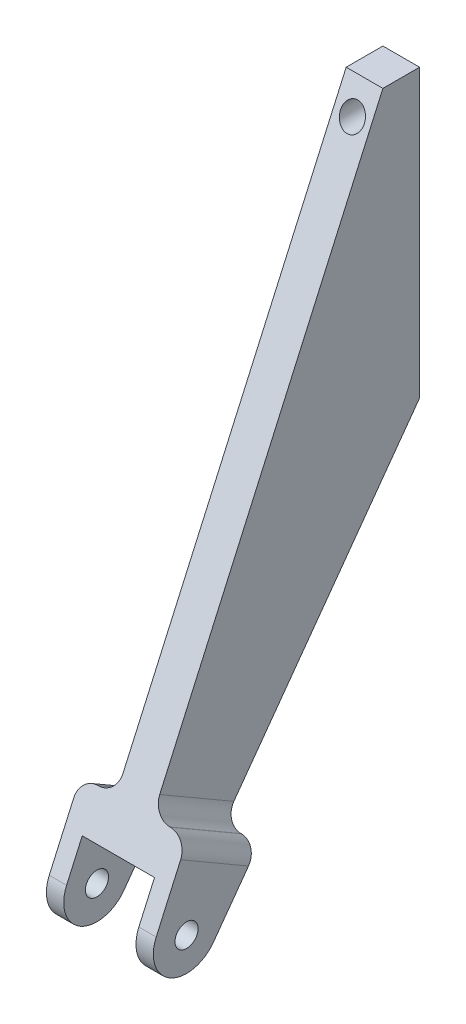
ISO-10303-21;
HEADER;
FILE_DESCRIPTION(('STEP AP214'),'2;1');
FILE_NAME('part.step','',(''),(''),'','','');
FILE_SCHEMA(('AUTOMOTIVE_DESIGN { 1 0 10303 214 1 1 1 1 }'));
ENDSEC;
DATA;
#1=APPLICATION_CONTEXT('core data for automotive mechanical design processes');
#2=APPLICATION_PROTOCOL_DEFINITION('international standard','automotive_design',2000,#1);
#3=PRODUCT_CONTEXT('',#1,'mechanical');
#4=PRODUCT('Part','Part','',(#3));
#5=PRODUCT_RELATED_PRODUCT_CATEGORY('part','',(#4));
#6=PRODUCT_DEFINITION_FORMATION('','',#4);
#7=PRODUCT_DEFINITION_CONTEXT('part definition',#1,'design');
#8=PRODUCT_DEFINITION('design','',#6,#7);
#9=PRODUCT_DEFINITION_SHAPE('','',#8);
#10=(LENGTH_UNIT() NAMED_UNIT(*) SI_UNIT(.MILLI.,.METRE.));
#11=(NAMED_UNIT(*) PLANE_ANGLE_UNIT() SI_UNIT($,.RADIAN.));
#12=(NAMED_UNIT(*) SI_UNIT($,.STERADIAN.) SOLID_ANGLE_UNIT());
#13=UNCERTAINTY_MEASURE_WITH_UNIT(LENGTH_MEASURE(1.E-05),#10,'distance_accuracy_value','');
#14=(GEOMETRIC_REPRESENTATION_CONTEXT(3) GLOBAL_UNCERTAINTY_ASSIGNED_CONTEXT((#13)) GLOBAL_UNIT_ASSIGNED_CONTEXT((#10,
#11,#12)) REPRESENTATION_CONTEXT('',''));
#15=CARTESIAN_POINT('',(0.,0.,0.));
#16=DIRECTION('',(0.,0.,1.));
#17=DIRECTION('',(1.,0.,0.));
#18=AXIS2_PLACEMENT_3D('',#15,#16,#17);
#19=CARTESIAN_POINT('',(-78.4084452466419,-210.483790761918,92.7733037843869));
#20=DIRECTION('',(1.,0.,0.));
#21=DIRECTION('',(0.,0.,-1.));
#22=AXIS2_PLACEMENT_3D('',#19,#20,#21);
#23=CYLINDRICAL_SURFACE('',#22,11.5);
#24=DIRECTION('',(1.,0.,0.));
#25=VECTOR('',#24,1.);
#26=CARTESIAN_POINT('',(-78.4084452466419,-205.796191727349,103.274561580056));
#27=LINE('',#26,#25);
#28=CARTESIAN_POINT('',(-59.5584452466419,-205.796191727349,103.274561580056));
#29=VERTEX_POINT('',#28);
#30=CARTESIAN_POINT('',(-53.558445246642,-205.796191727349,103.274561580056));
#31=VERTEX_POINT('',#30);
#32=EDGE_CURVE('E285',#29,#31,#27,.T.);
#33=ORIENTED_EDGE('',*,*,#32,.F.);
#34=CARTESIAN_POINT('',(-59.5584452466419,-210.483790761918,92.7733037843869));
#35=DIRECTION('',(-1.,0.,0.));
#36=DIRECTION('',(0.,0.,1.));
#37=AXIS2_PLACEMENT_3D('',#34,#35,#36);
#38=CIRCLE('',#37,11.5);
#39=CARTESIAN_POINT('',(-59.5584452466419,-217.229583095588,83.4596425391511));
#40=VERTEX_POINT('',#39);
#41=EDGE_CURVE('E211',#29,#40,#38,.F.);
#42=ORIENTED_EDGE('',*,*,#41,.T.);
#43=DIRECTION('',(1.,0.,0.));
#44=VECTOR('',#43,1.);
#45=CARTESIAN_POINT('',(-78.4084452466419,-217.229583095588,83.4596425391511));
#46=LINE('',#45,#44);
#47=CARTESIAN_POINT('',(-53.558445246642,-217.229583095588,83.4596425391511));
#48=VERTEX_POINT('',#47);
#49=EDGE_CURVE('E208',#40,#48,#46,.T.);
#50=ORIENTED_EDGE('',*,*,#49,.T.);
#51=CARTESIAN_POINT('',(-53.558445246642,-210.483790761918,92.7733037843869));
#52=DIRECTION('',(1.,0.,0.));
#53=DIRECTION('',(0.,0.,-1.));
#54=AXIS2_PLACEMENT_3D('',#51,#52,#53);
#55=CIRCLE('',#54,11.5);
#56=EDGE_CURVE('E236',#31,#48,#55,.T.);
#57=ORIENTED_EDGE('',*,*,#56,.F.);
#58=EDGE_LOOP('',(#33,#42,#50,#57));
#59=FACE_BOUND('',#58,.T.);
#60=ADVANCED_FACE('F63',(#59),#23,.T.);
#61=CARTESIAN_POINT('',(-78.4084452466419,-210.483790761918,92.7733037843869));
#62=DIRECTION('',(1.,0.,0.));
#63=DIRECTION('',(0.,0.,-1.));
#64=AXIS2_PLACEMENT_3D('',#61,#62,#63);
#65=CYLINDRICAL_SURFACE('',#64,4.00000000000001);
#66=CARTESIAN_POINT('',(-53.558445246642,-210.483790761918,92.7733037843869));
#67=DIRECTION('',(1.,0.,0.));
#68=DIRECTION('',(0.,0.,-1.));
#69=AXIS2_PLACEMENT_3D('',#66,#67,#68);
#70=CIRCLE('',#69,4.00000000000001);
#71=CARTESIAN_POINT('',(-53.558445246642,-210.483790761918,88.7733037843869));
#72=VERTEX_POINT('',#71);
#73=EDGE_CURVE('E228',#72,#72,#70,.T.);
#74=ORIENTED_EDGE('',*,*,#73,.T.);
#75=EDGE_LOOP('',(#74));
#76=FACE_BOUND('',#75,.T.);
#77=CARTESIAN_POINT('',(-59.5584452466419,-210.483790761918,92.7733037843869));
#78=DIRECTION('',(-1.,0.,0.));
#79=DIRECTION('',(0.,0.,1.));
#80=AXIS2_PLACEMENT_3D('',#77,#78,#79);
#81=CIRCLE('',#80,4.00000000000001);
#82=CARTESIAN_POINT('',(-59.5584452466419,-210.483790761918,96.7733037843869));
#83=VERTEX_POINT('',#82);
#84=EDGE_CURVE('E330',#83,#83,#81,.F.);
#85=ORIENTED_EDGE('',*,*,#84,.F.);
#86=EDGE_LOOP('',(#85));
#87=FACE_BOUND('',#86,.T.);
#88=ADVANCED_FACE('F439',(#76,#87),#65,.F.);
#89=CARTESIAN_POINT('',(-65.7084452466419,-322.212396424115,112.776));
#90=DIRECTION('',(-1.,0.,0.));
#91=DIRECTION('',(0.,0.,1.));
#92=AXIS2_PLACEMENT_3D('',#89,#90,#91);
#93=PLANE('',#92);
#94=DIRECTION('',(0.,-0.913152851797348,0.407617307353811));
#95=VECTOR('',#94,1.);
#96=CARTESIAN_POINT('',(-65.7084452466419,4.24711590624918,9.51447824157033));
#97=LINE('',#96,#95);
#98=CARTESIAN_POINT('',(-65.7084452466419,-2.88915683215951,12.7));
#99=VERTEX_POINT('',#98);
#100=CARTESIAN_POINT('',(-65.7084452466419,-175.850503739306,89.907269696208));
#101=VERTEX_POINT('',#100);
#102=EDGE_CURVE('E286',#99,#101,#97,.T.);
#103=ORIENTED_EDGE('',*,*,#102,.T.);
#104=DIRECTION('',(0.,0.501533068219234,0.865138475322073));
#105=VECTOR('',#104,1.);
#106=CARTESIAN_POINT('',(-65.7084452466419,-190.413005407479,64.7871304902103));
#107=LINE('',#106,#105);
#108=CARTESIAN_POINT('',(-65.7084452466419,-190.719409510616,64.2585871190584));
#109=VERTEX_POINT('',#108);
#110=EDGE_CURVE('E347',#101,#109,#107,.F.);
#111=ORIENTED_EDGE('',*,*,#110,.T.);
#112=DIRECTION('',(0.,-0.809883586542247,0.586590637710377));
#113=VECTOR('',#112,1.);
#114=CARTESIAN_POINT('',(-65.7084452466419,-35.0970347774456,-48.4571532091004));
#115=LINE('',#114,#113);
#116=CARTESIAN_POINT('',(-65.7084452466419,-102.,0.));
#117=VERTEX_POINT('',#116);
#118=EDGE_CURVE('E281',#117,#109,#115,.T.);
#119=ORIENTED_EDGE('',*,*,#118,.F.);
#120=DIRECTION('',(0.,1.,0.));
#121=VECTOR('',#120,1.);
#122=CARTESIAN_POINT('',(-65.7084452466419,-322.212396424115,0.));
#123=LINE('',#122,#121);
#124=CARTESIAN_POINT('',(-65.7084452466419,-2.88915683215951,0.));
#125=VERTEX_POINT('',#124);
#126=EDGE_CURVE('E297',#117,#125,#123,.T.);
#127=ORIENTED_EDGE('',*,*,#126,.T.);
#128=DIRECTION('',(0.,0.,-1.));
#129=VECTOR('',#128,1.);
#130=CARTESIAN_POINT('',(-65.7084452466419,-2.88915683215951,112.776));
#131=LINE('',#130,#129);
#132=EDGE_CURVE('E323',#99,#125,#131,.T.);
#133=ORIENTED_EDGE('',*,*,#132,.F.);
#134=EDGE_LOOP('',(#103,#111,#119,#127,#133));
#135=FACE_BOUND('',#134,.T.);
#136=ADVANCED_FACE('F425',(#135),#93,.F.);
#137=CARTESIAN_POINT('',(-78.4084452466419,-322.212396424115,112.776));
#138=DIRECTION('',(1.,0.,0.));
#139=DIRECTION('',(0.,0.,-1.));
#140=AXIS2_PLACEMENT_3D('',#137,#138,#139);
#141=PLANE('',#140);
#142=DIRECTION('',(0.,-0.809883586542247,0.586590637710377));
#143=VECTOR('',#142,1.);
#144=CARTESIAN_POINT('',(-78.4084452466419,-35.0970347774456,-48.4571532091004));
#145=LINE('',#144,#143);
#146=CARTESIAN_POINT('',(-78.4084452466419,-102.,0.));
#147=VERTEX_POINT('',#146);
#148=CARTESIAN_POINT('',(-78.4084452466419,-190.719409510616,64.2585871190584));
#149=VERTEX_POINT('',#148);
#150=EDGE_CURVE('E280',#147,#149,#145,.T.);
#151=ORIENTED_EDGE('',*,*,#150,.T.);
#152=DIRECTION('',(0.,-0.501533068219234,-0.865138475322073));
#153=VECTOR('',#152,1.);
#154=CARTESIAN_POINT('',(-78.4084452466419,-176.169238473201,89.3574561361695));
#155=LINE('',#154,#153);
#156=CARTESIAN_POINT('',(-78.4084452466419,-175.850503739306,89.907269696208));
#157=VERTEX_POINT('',#156);
#158=EDGE_CURVE('E340',#149,#157,#155,.F.);
#159=ORIENTED_EDGE('',*,*,#158,.T.);
#160=DIRECTION('',(0.,-0.913152851797348,0.407617307353811));
#161=VECTOR('',#160,1.);
#162=CARTESIAN_POINT('',(-78.4084452466419,4.24711590624918,9.51447824157033));
#163=LINE('',#162,#161);
#164=CARTESIAN_POINT('',(-78.4084452466419,-2.88915683215951,12.7));
#165=VERTEX_POINT('',#164);
#166=EDGE_CURVE('E276',#165,#157,#163,.T.);
#167=ORIENTED_EDGE('',*,*,#166,.F.);
#168=DIRECTION('',(0.,0.,-1.));
#169=VECTOR('',#168,1.);
#170=CARTESIAN_POINT('',(-78.4084452466419,-2.88915683215951,112.776));
#171=LINE('',#170,#169);
#172=CARTESIAN_POINT('',(-78.4084452466419,-2.88915683215951,0.));
#173=VERTEX_POINT('',#172);
#174=EDGE_CURVE('E320',#165,#173,#171,.T.);
#175=ORIENTED_EDGE('',*,*,#174,.T.);
#176=DIRECTION('',(0.,-1.,0.));
#177=VECTOR('',#176,1.);
#178=CARTESIAN_POINT('',(-78.4084452466419,-322.212396424115,0.));
#179=LINE('',#178,#177);
#180=EDGE_CURVE('E316',#173,#147,#179,.T.);
#181=ORIENTED_EDGE('',*,*,#180,.T.);
#182=EDGE_LOOP('',(#151,#159,#167,#175,#181));
#183=FACE_BOUND('',#182,.T.);
#184=ADVANCED_FACE('F414',(#183),#141,.F.);
#185=CARTESIAN_POINT('',(-78.4084452466419,-2.88915683215951,112.776));
#186=DIRECTION('',(0.,-1.,0.));
#187=DIRECTION('',(0.,0.,-1.));
#188=AXIS2_PLACEMENT_3D('',#185,#186,#187);
#189=PLANE('',#188);
#190=DIRECTION('',(1.,0.,0.));
#191=VECTOR('',#190,1.);
#192=CARTESIAN_POINT('',(-78.4084452466419,-2.88915683215951,12.7));
#193=LINE('',#192,#191);
#194=EDGE_CURVE('E301',#165,#99,#193,.T.);
#195=ORIENTED_EDGE('',*,*,#194,.T.);
#196=ORIENTED_EDGE('',*,*,#132,.T.);
#197=DIRECTION('',(-1.,0.,0.));
#198=VECTOR('',#197,1.);
#199=CARTESIAN_POINT('',(-78.4084452466419,-2.88915683215951,0.));
#200=LINE('',#199,#198);
#201=EDGE_CURVE('E312',#125,#173,#200,.T.);
#202=ORIENTED_EDGE('',*,*,#201,.T.);
#203=ORIENTED_EDGE('',*,*,#174,.F.);
#204=EDGE_LOOP('',(#195,#196,#202,#203));
#205=FACE_BOUND('',#204,.T.);
#206=ADVANCED_FACE('F457',(#205),#189,.F.);
#207=CARTESIAN_POINT('',(0.,0.,0.));
#208=DIRECTION('',(0.,0.,-1.));
#209=DIRECTION('',(-1.,0.,0.));
#210=AXIS2_PLACEMENT_3D('',#207,#208,#209);
#211=PLANE('',#210);
#212=CARTESIAN_POINT('',(-72.,-12.4141568321594,0.));
#213=DIRECTION('',(0.,0.,-1.));
#214=DIRECTION('',(-1.,0.,0.));
#215=AXIS2_PLACEMENT_3D('',#212,#213,#214);
#216=CIRCLE('',#215,4.12750000000001);
#217=CARTESIAN_POINT('',(-76.1275,-12.4141568321594,0.));
#218=VERTEX_POINT('',#217);
#219=EDGE_CURVE('E264',#218,#218,#216,.T.);
#220=ORIENTED_EDGE('',*,*,#219,.F.);
#221=EDGE_LOOP('',(#220));
#222=FACE_BOUND('',#221,.T.);
#223=CARTESIAN_POINT('',(-72.,-91.7891568321594,0.));
#224=DIRECTION('',(0.,0.,-1.));
#225=DIRECTION('',(-1.,0.,0.));
#226=AXIS2_PLACEMENT_3D('',#223,#224,#225);
#227=CIRCLE('',#226,4.12750000000001);
#228=CARTESIAN_POINT('',(-76.1275,-91.7891568321594,0.));
#229=VERTEX_POINT('',#228);
#230=EDGE_CURVE('E263',#229,#229,#227,.T.);
#231=ORIENTED_EDGE('',*,*,#230,.F.);
#232=EDGE_LOOP('',(#231));
#233=FACE_BOUND('',#232,.T.);
#234=DIRECTION('',(1.,0.,0.));
#235=VECTOR('',#234,1.);
#236=CARTESIAN_POINT('',(-78.4084452466419,-102.,0.));
#237=LINE('',#236,#235);
#238=EDGE_CURVE('E298',#147,#117,#237,.T.);
#239=ORIENTED_EDGE('',*,*,#238,.F.);
#240=ORIENTED_EDGE('',*,*,#180,.F.);
#241=ORIENTED_EDGE('',*,*,#201,.F.);
#242=ORIENTED_EDGE('',*,*,#126,.F.);
#243=EDGE_LOOP('',(#239,#240,#241,#242));
#244=FACE_BOUND('',#243,.T.);
#245=ADVANCED_FACE('F420',(#222,#233,#244),#211,.T.);
#246=CARTESIAN_POINT('',(-84.5584452466419,-210.483790761918,92.7733037843869));
#247=DIRECTION('',(-1.,0.,0.));
#248=DIRECTION('',(0.,0.,1.));
#249=AXIS2_PLACEMENT_3D('',#246,#247,#248);
#250=CIRCLE('',#249,11.5);
#251=CARTESIAN_POINT('',(-84.5584452466419,-205.796191727349,103.274561580056));
#252=VERTEX_POINT('',#251);
#253=CARTESIAN_POINT('',(-84.5584452466419,-217.229583095588,83.4596425391511));
#254=VERTEX_POINT('',#253);
#255=EDGE_CURVE('E223',#252,#254,#250,.F.);
#256=ORIENTED_EDGE('',*,*,#255,.F.);
#257=CARTESIAN_POINT('',(-90.558445246642,-205.796191727349,103.274561580056));
#258=VERTEX_POINT('',#257);
#259=EDGE_CURVE('E305',#258,#252,#27,.T.);
#260=ORIENTED_EDGE('',*,*,#259,.F.);
#261=CARTESIAN_POINT('',(-90.558445246642,-210.483790761918,92.7733037843869));
#262=DIRECTION('',(1.,0.,0.));
#263=DIRECTION('',(0.,0.,-1.));
#264=AXIS2_PLACEMENT_3D('',#261,#262,#263);
#265=CIRCLE('',#264,11.5);
#266=CARTESIAN_POINT('',(-90.558445246642,-217.229583095588,83.4596425391511));
#267=VERTEX_POINT('',#266);
#268=EDGE_CURVE('E232',#258,#267,#265,.T.);
#269=ORIENTED_EDGE('',*,*,#268,.T.);
#270=EDGE_CURVE('E293',#267,#254,#46,.T.);
#271=ORIENTED_EDGE('',*,*,#270,.T.);
#272=EDGE_LOOP('',(#256,#260,#269,#271));
#273=FACE_BOUND('',#272,.T.);
#274=ADVANCED_FACE('F441',(#273),#23,.T.);
#275=CARTESIAN_POINT('',(-78.4084452466419,-35.0970347774456,-48.4571532091004));
#276=DIRECTION('',(0.,0.586590637710377,0.809883586542247));
#277=DIRECTION('',(0.,-0.809883586542247,0.586590637710377));
#278=AXIS2_PLACEMENT_3D('',#275,#276,#277);
#279=PLANE('',#278);
#280=DIRECTION('',(0.,0.809883586542247,-0.586590637710377));
#281=VECTOR('',#280,1.);
#282=CARTESIAN_POINT('',(-90.558445246642,-195.603836259411,67.7963288995257));
#283=LINE('',#282,#281);
#284=CARTESIAN_POINT('',(-90.558445246642,-200.488263008206,71.3340706799931));
#285=VERTEX_POINT('',#284);
#286=EDGE_CURVE('E251',#267,#285,#283,.T.);
#287=ORIENTED_EDGE('',*,*,#286,.T.);
#288=CARTESIAN_POINT('',(-84.558445246642,-200.488263008206,71.3340706799931));
#289=DIRECTION('',(0.,0.586590637710377,0.809883586542247));
#290=DIRECTION('',(0.,-0.809883586542247,0.586590637710377));
#291=AXIS2_PLACEMENT_3D('',#288,#289,#290);
#292=ELLIPSE('',#291,6.03102326057595,6.);
#293=CARTESIAN_POINT('',(-84.558445246642,-195.603836259411,67.7963288995257));
#294=VERTEX_POINT('',#293);
#295=EDGE_CURVE('E378',#285,#294,#292,.F.);
#296=ORIENTED_EDGE('',*,*,#295,.T.);
#297=DIRECTION('',(-1.,0.,0.));
#298=VECTOR('',#297,1.);
#299=CARTESIAN_POINT('',(-53.558445246642,-195.603836259411,67.7963288995257));
#300=LINE('',#299,#298);
#301=CARTESIAN_POINT('',(-84.408445246642,-195.603836259411,67.7963288995257));
#302=VERTEX_POINT('',#301);
#303=EDGE_CURVE('E259',#302,#294,#300,.T.);
#304=ORIENTED_EDGE('',*,*,#303,.F.);
#305=CARTESIAN_POINT('',(-84.408445246642,-190.719409510616,64.2585871190584));
#306=DIRECTION('',(0.,0.586590637710377,0.809883586542247));
#307=DIRECTION('',(0.,-0.809883586542247,0.586590637710377));
#308=AXIS2_PLACEMENT_3D('',#305,#306,#307);
#309=ELLIPSE('',#308,6.03102326057595,6.);
#310=EDGE_CURVE('E350',#302,#149,#309,.T.);
#311=ORIENTED_EDGE('',*,*,#310,.T.);
#312=ORIENTED_EDGE('',*,*,#150,.F.);
#313=ORIENTED_EDGE('',*,*,#238,.T.);
#314=ORIENTED_EDGE('',*,*,#118,.T.);
#315=CARTESIAN_POINT('',(-59.708445246642,-190.719409510616,64.2585871190584));
#316=DIRECTION('',(0.,0.586590637710377,0.809883586542247));
#317=DIRECTION('',(0.,0.809883586542247,-0.586590637710377));
#318=AXIS2_PLACEMENT_3D('',#315,#316,#317);
#319=ELLIPSE('',#318,6.03102326057595,6.);
#320=CARTESIAN_POINT('',(-59.708445246642,-195.603836259411,67.7963288995257));
#321=VERTEX_POINT('',#320);
#322=EDGE_CURVE('E359',#109,#321,#319,.T.);
#323=ORIENTED_EDGE('',*,*,#322,.T.);
#324=CARTESIAN_POINT('',(-59.558445246642,-195.603836259411,67.7963288995257));
#325=VERTEX_POINT('',#324);
#326=EDGE_CURVE('E260',#325,#321,#300,.T.);
#327=ORIENTED_EDGE('',*,*,#326,.F.);
#328=CARTESIAN_POINT('',(-59.558445246642,-200.488263008206,71.3340706799931));
#329=DIRECTION('',(0.,0.586590637710377,0.809883586542247));
#330=DIRECTION('',(0.,0.809883586542247,-0.586590637710377));
#331=AXIS2_PLACEMENT_3D('',#328,#329,#330);
#332=ELLIPSE('',#331,6.03102326057595,6.);
#333=CARTESIAN_POINT('',(-53.558445246642,-200.488263008206,71.3340706799931));
#334=VERTEX_POINT('',#333);
#335=EDGE_CURVE('E79',#325,#334,#332,.F.);
#336=ORIENTED_EDGE('',*,*,#335,.T.);
#337=DIRECTION('',(0.,0.809883586542247,-0.586590637710377));
#338=VECTOR('',#337,1.);
#339=CARTESIAN_POINT('',(-53.558445246642,-195.603836259411,67.7963288995257));
#340=LINE('',#339,#338);
#341=EDGE_CURVE('E240',#48,#334,#340,.T.);
#342=ORIENTED_EDGE('',*,*,#341,.F.);
#343=ORIENTED_EDGE('',*,*,#49,.F.);
#344=DIRECTION('',(0.,-0.809883586542247,0.586590637710377));
#345=VECTOR('',#344,1.);
#346=CARTESIAN_POINT('',(-59.5584452466419,-35.0970347774456,-48.4571532091004));
#347=LINE('',#346,#345);
#348=CARTESIAN_POINT('',(-59.5584452466419,-206.51238933172,75.6972855425695));
#349=VERTEX_POINT('',#348);
#350=EDGE_CURVE('E199',#349,#40,#347,.T.);
#351=ORIENTED_EDGE('',*,*,#350,.F.);
#352=DIRECTION('',(-1.,0.,0.));
#353=VECTOR('',#352,1.);
#354=CARTESIAN_POINT('',(-78.4084452466419,-206.51238933172,75.6972855425695));
#355=LINE('',#354,#353);
#356=CARTESIAN_POINT('',(-84.558445246642,-206.51238933172,75.6972855425695));
#357=VERTEX_POINT('',#356);
#358=EDGE_CURVE('E184',#349,#357,#355,.T.);
#359=ORIENTED_EDGE('',*,*,#358,.T.);
#360=DIRECTION('',(0.,-0.809883586542247,0.586590637710377));
#361=VECTOR('',#360,1.);
#362=CARTESIAN_POINT('',(-84.5584452466419,-35.0970347774456,-48.4571532091004));
#363=LINE('',#362,#361);
#364=EDGE_CURVE('E195',#357,#254,#363,.T.);
#365=ORIENTED_EDGE('',*,*,#364,.T.);
#366=ORIENTED_EDGE('',*,*,#270,.F.);
#367=EDGE_LOOP('',(#287,#296,#304,#311,#312,#313,#314,#323,#327,#336,#342,#343,#351,#359,#365,#366));
#368=FACE_BOUND('',#367,.T.);
#369=ADVANCED_FACE('F207',(#368),#279,.F.);
#370=CARTESIAN_POINT('',(-78.4084452466419,4.24711590624918,9.51447824157033));
#371=DIRECTION('',(0.,0.407617307353811,0.913152851797348));
#372=DIRECTION('',(0.,-0.913152851797348,0.407617307353811));
#373=AXIS2_PLACEMENT_3D('',#370,#371,#372);
#374=PLANE('',#373);
#375=DIRECTION('',(-1.,0.,0.));
#376=VECTOR('',#375,1.);
#377=CARTESIAN_POINT('',(-53.558445246642,-181.360069325134,92.3666545454849));
#378=LINE('',#377,#376);
#379=CARTESIAN_POINT('',(-84.408445246642,-181.360069325134,92.3666545454849));
#380=VERTEX_POINT('',#379);
#381=CARTESIAN_POINT('',(-84.558445246642,-181.360069325134,92.3666545454849));
#382=VERTEX_POINT('',#381);
#383=EDGE_CURVE('E247',#380,#382,#378,.T.);
#384=ORIENTED_EDGE('',*,*,#383,.T.);
#385=CARTESIAN_POINT('',(-84.558445246642,-186.869634910962,94.8260393947619));
#386=DIRECTION('',(0.,0.407617307353811,0.913152851797348));
#387=DIRECTION('',(0.,0.913152851797348,-0.407617307353811));
#388=AXIS2_PLACEMENT_3D('',#385,#386,#387);
#389=ELLIPSE('',#388,6.03356335687242,6.);
#390=CARTESIAN_POINT('',(-90.558445246642,-186.869634910962,94.8260393947619));
#391=VERTEX_POINT('',#390);
#392=EDGE_CURVE('E370',#382,#391,#389,.T.);
#393=ORIENTED_EDGE('',*,*,#392,.T.);
#394=DIRECTION('',(0.,-0.913152851797348,0.40761730735381));
#395=VECTOR('',#394,1.);
#396=CARTESIAN_POINT('',(-90.558445246642,-205.796191727349,103.274561580056));
#397=LINE('',#396,#395);
#398=EDGE_CURVE('E241',#391,#258,#397,.T.);
#399=ORIENTED_EDGE('',*,*,#398,.T.);
#400=ORIENTED_EDGE('',*,*,#259,.T.);
#401=DIRECTION('',(0.,-0.913152851797348,0.407617307353811));
#402=VECTOR('',#401,1.);
#403=CARTESIAN_POINT('',(-84.5584452466419,4.24711590624918,9.51447824157033));
#404=LINE('',#403,#402);
#405=CARTESIAN_POINT('',(-84.558445246642,-193.66476580015,97.8592807088701));
#406=VERTEX_POINT('',#405);
#407=EDGE_CURVE('E216',#406,#252,#404,.T.);
#408=ORIENTED_EDGE('',*,*,#407,.F.);
#409=DIRECTION('',(-1.,0.,0.));
#410=VECTOR('',#409,1.);
#411=CARTESIAN_POINT('',(-78.4084452466419,-193.66476580015,97.8592807088701));
#412=LINE('',#411,#410);
#413=CARTESIAN_POINT('',(-59.5584452466419,-193.66476580015,97.8592807088701));
#414=VERTEX_POINT('',#413);
#415=EDGE_CURVE('E326',#414,#406,#412,.T.);
#416=ORIENTED_EDGE('',*,*,#415,.F.);
#417=DIRECTION('',(0.,-0.913152851797348,0.407617307353811));
#418=VECTOR('',#417,1.);
#419=CARTESIAN_POINT('',(-59.5584452466419,4.24711590624918,9.51447824157033));
#420=LINE('',#419,#418);
#421=EDGE_CURVE('E202',#414,#29,#420,.T.);
#422=ORIENTED_EDGE('',*,*,#421,.T.);
#423=ORIENTED_EDGE('',*,*,#32,.T.);
#424=DIRECTION('',(0.,-0.913152851797348,0.40761730735381));
#425=VECTOR('',#424,1.);
#426=CARTESIAN_POINT('',(-53.558445246642,-205.796191727349,103.274561580056));
#427=LINE('',#426,#425);
#428=CARTESIAN_POINT('',(-53.558445246642,-186.869634910962,94.8260393947619));
#429=VERTEX_POINT('',#428);
#430=EDGE_CURVE('E244',#429,#31,#427,.T.);
#431=ORIENTED_EDGE('',*,*,#430,.F.);
#432=CARTESIAN_POINT('',(-59.558445246642,-186.869634910962,94.8260393947619));
#433=DIRECTION('',(0.,0.407617307353811,0.913152851797348));
#434=DIRECTION('',(0.,-0.913152851797348,0.407617307353811));
#435=AXIS2_PLACEMENT_3D('',#432,#433,#434);
#436=ELLIPSE('',#435,6.03356335687242,6.);
#437=CARTESIAN_POINT('',(-59.558445246642,-181.360069325134,92.3666545454849));
#438=VERTEX_POINT('',#437);
#439=EDGE_CURVE('E367',#429,#438,#436,.T.);
#440=ORIENTED_EDGE('',*,*,#439,.T.);
#441=CARTESIAN_POINT('',(-59.708445246642,-181.360069325134,92.3666545454849));
#442=VERTEX_POINT('',#441);
#443=EDGE_CURVE('E256',#438,#442,#378,.T.);
#444=ORIENTED_EDGE('',*,*,#443,.T.);
#445=CARTESIAN_POINT('',(-59.708445246642,-175.850503739306,89.907269696208));
#446=DIRECTION('',(0.,0.407617307353811,0.913152851797348));
#447=DIRECTION('',(0.,-0.913152851797348,0.407617307353811));
#448=AXIS2_PLACEMENT_3D('',#445,#446,#447);
#449=ELLIPSE('',#448,6.03356335687242,6.);
#450=EDGE_CURVE('E356',#442,#101,#449,.F.);
#451=ORIENTED_EDGE('',*,*,#450,.T.);
#452=ORIENTED_EDGE('',*,*,#102,.F.);
#453=ORIENTED_EDGE('',*,*,#194,.F.);
#454=ORIENTED_EDGE('',*,*,#166,.T.);
#455=CARTESIAN_POINT('',(-84.408445246642,-175.850503739306,89.907269696208));
#456=DIRECTION('',(0.,0.407617307353811,0.913152851797348));
#457=DIRECTION('',(0.,0.913152851797348,-0.407617307353811));
#458=AXIS2_PLACEMENT_3D('',#455,#456,#457);
#459=ELLIPSE('',#458,6.03356335687242,6.);
#460=EDGE_CURVE('E353',#157,#380,#459,.F.);
#461=ORIENTED_EDGE('',*,*,#460,.T.);
#462=EDGE_LOOP('',(#384,#393,#399,#400,#408,#416,#422,#423,#431,#440,#444,#451,#452,#453,#454,#461));
#463=FACE_BOUND('',#462,.T.);
#464=CARTESIAN_POINT('',(-72.,-12.4141568321594,16.9518126564496));
#465=DIRECTION('',(0.,0.407617307353811,0.913152851797348));
#466=DIRECTION('',(0.,0.913152851797348,-0.407617307353811));
#467=AXIS2_PLACEMENT_3D('',#464,#465,#466);
#468=ELLIPSE('',#467,4.52005378056467,4.12750000000001);
#469=CARTESIAN_POINT('',(-72.,-8.28665683215941,15.1093605053214));
#470=VERTEX_POINT('',#469);
#471=EDGE_CURVE('E268',#470,#470,#468,.T.);
#472=ORIENTED_EDGE('',*,*,#471,.F.);
#473=EDGE_LOOP('',(#472));
#474=FACE_BOUND('',#473,.T.);
#475=ADVANCED_FACE('F391',(#463,#474),#374,.T.);
#476=CARTESIAN_POINT('',(-72.,-12.4141568321594,25.4));
#477=DIRECTION('',(0.,0.,-1.));
#478=DIRECTION('',(-1.,0.,0.));
#479=AXIS2_PLACEMENT_3D('',#476,#477,#478);
#480=CYLINDRICAL_SURFACE('',#479,4.12750000000001);
#481=ORIENTED_EDGE('',*,*,#471,.T.);
#482=EDGE_LOOP('',(#481));
#483=FACE_BOUND('',#482,.T.);
#484=ORIENTED_EDGE('',*,*,#219,.T.);
#485=EDGE_LOOP('',(#484));
#486=FACE_BOUND('',#485,.T.);
#487=ADVANCED_FACE('F493',(#483,#486),#480,.F.);
#488=CARTESIAN_POINT('',(-72.,-91.7891568321594,25.4));
#489=DIRECTION('',(0.,0.,-1.));
#490=DIRECTION('',(-1.,0.,0.));
#491=AXIS2_PLACEMENT_3D('',#488,#489,#490);
#492=CYLINDRICAL_SURFACE('',#491,4.12750000000001);
#493=CARTESIAN_POINT('',(-72.,-91.7891568321594,25.4));
#494=DIRECTION('',(0.,0.,-1.));
#495=DIRECTION('',(-1.,0.,0.));
#496=AXIS2_PLACEMENT_3D('',#493,#494,#495);
#497=CIRCLE('',#496,4.12750000000001);
#498=CARTESIAN_POINT('',(-76.1275,-91.7891568321594,25.4));
#499=VERTEX_POINT('',#498);
#500=EDGE_CURVE('E269',#499,#499,#497,.T.);
#501=ORIENTED_EDGE('',*,*,#500,.F.);
#502=EDGE_LOOP('',(#501));
#503=FACE_BOUND('',#502,.T.);
#504=ORIENTED_EDGE('',*,*,#230,.T.);
#505=EDGE_LOOP('',(#504));
#506=FACE_BOUND('',#505,.T.);
#507=ADVANCED_FACE('F496',(#503,#506),#492,.F.);
#508=CARTESIAN_POINT('',(-72.,-91.7891568321594,25.4));
#509=DIRECTION('',(0.,0.,-1.));
#510=DIRECTION('',(-1.,0.,0.));
#511=AXIS2_PLACEMENT_3D('',#508,#509,#510);
#512=PLANE('',#511);
#513=ORIENTED_EDGE('',*,*,#500,.T.);
#514=EDGE_LOOP('',(#513));
#515=FACE_BOUND('',#514,.T.);
#516=ADVANCED_FACE('F498',(#515),#512,.T.);
#517=CARTESIAN_POINT('',(-53.558445246642,-181.360069325134,92.3666545454849));
#518=DIRECTION('',(0.,-0.865138475322073,0.501533068219234));
#519=DIRECTION('',(0.,-0.501533068219234,-0.865138475322073));
#520=AXIS2_PLACEMENT_3D('',#517,#518,#519);
#521=PLANE('',#520);
#522=ORIENTED_EDGE('',*,*,#303,.T.);
#523=DIRECTION('',(0.,0.501533068219234,0.865138475322073));
#524=VECTOR('',#523,1.);
#525=CARTESIAN_POINT('',(-84.558445246642,-181.360069325134,92.3666545454849));
#526=LINE('',#525,#524);
#527=EDGE_CURVE('E363',#294,#382,#526,.T.);
#528=ORIENTED_EDGE('',*,*,#527,.T.);
#529=ORIENTED_EDGE('',*,*,#383,.F.);
#530=DIRECTION('',(0.,-0.501533068219234,-0.865138475322073));
#531=VECTOR('',#530,1.);
#532=CARTESIAN_POINT('',(-84.408445246642,-195.603836259411,67.7963288995257));
#533=LINE('',#532,#531);
#534=EDGE_CURVE('E336',#380,#302,#533,.T.);
#535=ORIENTED_EDGE('',*,*,#534,.T.);
#536=EDGE_LOOP('',(#522,#528,#529,#535));
#537=FACE_BOUND('',#536,.T.);
#538=ADVANCED_FACE('F406',(#537),#521,.F.);
#539=CARTESIAN_POINT('',(-90.558445246642,-210.483790761918,92.7733037843869));
#540=DIRECTION('',(1.,0.,0.));
#541=DIRECTION('',(0.,0.,-1.));
#542=AXIS2_PLACEMENT_3D('',#539,#540,#541);
#543=PLANE('',#542);
#544=ORIENTED_EDGE('',*,*,#398,.F.);
#545=DIRECTION('',(0.,0.501533068219234,0.865138475322073));
#546=VECTOR('',#545,1.);
#547=CARTESIAN_POINT('',(-90.558445246642,-193.70010434067,83.0435622609338));
#548=LINE('',#547,#546);
#549=EDGE_CURVE('E373',#391,#285,#548,.F.);
#550=ORIENTED_EDGE('',*,*,#549,.T.);
#551=ORIENTED_EDGE('',*,*,#286,.F.);
#552=ORIENTED_EDGE('',*,*,#268,.F.);
#553=EDGE_LOOP('',(#544,#550,#551,#552));
#554=FACE_BOUND('',#553,.T.);
#555=CARTESIAN_POINT('',(-90.558445246642,-210.483790761918,92.7733037843869));
#556=DIRECTION('',(1.,0.,0.));
#557=DIRECTION('',(0.,0.,-1.));
#558=AXIS2_PLACEMENT_3D('',#555,#556,#557);
#559=CIRCLE('',#558,4.00000000000001);
#560=CARTESIAN_POINT('',(-90.558445246642,-210.483790761918,88.7733037843869));
#561=VERTEX_POINT('',#560);
#562=EDGE_CURVE('E194',#561,#561,#559,.T.);
#563=ORIENTED_EDGE('',*,*,#562,.T.);
#564=EDGE_LOOP('',(#563));
#565=FACE_BOUND('',#564,.T.);
#566=ADVANCED_FACE('F466',(#554,#565),#543,.F.);
#567=CARTESIAN_POINT('',(-84.5584452466419,-210.483790761918,92.7733037843869));
#568=DIRECTION('',(-1.,0.,0.));
#569=DIRECTION('',(0.,0.,1.));
#570=AXIS2_PLACEMENT_3D('',#567,#568,#569);
#571=CIRCLE('',#570,4.00000000000001);
#572=CARTESIAN_POINT('',(-84.5584452466419,-210.483790761918,96.7733037843869));
#573=VERTEX_POINT('',#572);
#574=EDGE_CURVE('E210',#573,#573,#571,.F.);
#575=ORIENTED_EDGE('',*,*,#574,.T.);
#576=EDGE_LOOP('',(#575));
#577=FACE_BOUND('',#576,.T.);
#578=ORIENTED_EDGE('',*,*,#562,.F.);
#579=EDGE_LOOP('',(#578));
#580=FACE_BOUND('',#579,.T.);
#581=ADVANCED_FACE('F447',(#577,#580),#65,.F.);
#582=ORIENTED_EDGE('',*,*,#443,.F.);
#583=DIRECTION('',(0.,0.501533068219234,0.865138475322073));
#584=VECTOR('',#583,1.);
#585=CARTESIAN_POINT('',(-59.558445246642,-195.603836259411,67.7963288995257));
#586=LINE('',#585,#584);
#587=EDGE_CURVE('E12',#438,#325,#586,.F.);
#588=ORIENTED_EDGE('',*,*,#587,.T.);
#589=ORIENTED_EDGE('',*,*,#326,.T.);
#590=DIRECTION('',(0.,0.501533068219234,0.865138475322073));
#591=VECTOR('',#590,1.);
#592=CARTESIAN_POINT('',(-59.708445246642,-181.360069325134,92.3666545454849));
#593=LINE('',#592,#591);
#594=EDGE_CURVE('E343',#321,#442,#593,.T.);
#595=ORIENTED_EDGE('',*,*,#594,.T.);
#596=EDGE_LOOP('',(#582,#588,#589,#595));
#597=FACE_BOUND('',#596,.T.);
#598=ADVANCED_FACE('F488',(#597),#521,.F.);
#599=CARTESIAN_POINT('',(-53.558445246642,-210.483790761918,92.7733037843869));
#600=DIRECTION('',(1.,0.,0.));
#601=DIRECTION('',(0.,0.,-1.));
#602=AXIS2_PLACEMENT_3D('',#599,#600,#601);
#603=PLANE('',#602);
#604=ORIENTED_EDGE('',*,*,#341,.T.);
#605=DIRECTION('',(0.,0.501533068219234,0.865138475322073));
#606=VECTOR('',#605,1.);
#607=CARTESIAN_POINT('',(-53.558445246642,-186.550900177066,95.3758529548004));
#608=LINE('',#607,#606);
#609=EDGE_CURVE('E72',#334,#429,#608,.T.);
#610=ORIENTED_EDGE('',*,*,#609,.T.);
#611=ORIENTED_EDGE('',*,*,#430,.T.);
#612=ORIENTED_EDGE('',*,*,#56,.T.);
#613=EDGE_LOOP('',(#604,#610,#611,#612));
#614=FACE_BOUND('',#613,.T.);
#615=ORIENTED_EDGE('',*,*,#73,.F.);
#616=EDGE_LOOP('',(#615));
#617=FACE_BOUND('',#616,.T.);
#618=ADVANCED_FACE('F385',(#614,#617),#603,.T.);
#619=CARTESIAN_POINT('',(-84.558445246642,-185.02193427745,112.768060527842));
#620=DIRECTION('',(0.,0.865138475322073,-0.501533068219234));
#621=DIRECTION('',(0.,0.501533068219234,0.865138475322073));
#622=AXIS2_PLACEMENT_3D('',#619,#620,#621);
#623=PLANE('',#622);
#624=DIRECTION('',(0.,0.501533068219234,0.865138475322073));
#625=VECTOR('',#624,1.);
#626=CARTESIAN_POINT('',(-59.558445246642,-185.02193427745,112.768060527842));
#627=LINE('',#626,#625);
#628=EDGE_CURVE('E187',#349,#414,#627,.T.);
#629=ORIENTED_EDGE('',*,*,#628,.T.);
#630=ORIENTED_EDGE('',*,*,#415,.T.);
#631=DIRECTION('',(0.,0.501533068219234,0.865138475322073));
#632=VECTOR('',#631,1.);
#633=CARTESIAN_POINT('',(-84.558445246642,-185.02193427745,112.768060527842));
#634=LINE('',#633,#632);
#635=EDGE_CURVE('E190',#357,#406,#634,.T.);
#636=ORIENTED_EDGE('',*,*,#635,.F.);
#637=ORIENTED_EDGE('',*,*,#358,.F.);
#638=EDGE_LOOP('',(#629,#630,#636,#637));
#639=FACE_BOUND('',#638,.T.);
#640=ADVANCED_FACE('F186',(#639),#623,.F.);
#641=CARTESIAN_POINT('',(-84.5584452466419,0.,0.));
#642=DIRECTION('',(-1.,0.,0.));
#643=DIRECTION('',(0.,0.,1.));
#644=AXIS2_PLACEMENT_3D('',#641,#642,#643);
#645=PLANE('',#644);
#646=ORIENTED_EDGE('',*,*,#574,.F.);
#647=EDGE_LOOP('',(#646));
#648=FACE_BOUND('',#647,.T.);
#649=ORIENTED_EDGE('',*,*,#635,.T.);
#650=ORIENTED_EDGE('',*,*,#407,.T.);
#651=ORIENTED_EDGE('',*,*,#255,.T.);
#652=ORIENTED_EDGE('',*,*,#364,.F.);
#653=EDGE_LOOP('',(#649,#650,#651,#652));
#654=FACE_BOUND('',#653,.T.);
#655=ADVANCED_FACE('F470',(#648,#654),#645,.F.);
#656=CARTESIAN_POINT('',(-59.5584452466419,0.,0.));
#657=DIRECTION('',(-1.,0.,0.));
#658=DIRECTION('',(0.,0.,1.));
#659=AXIS2_PLACEMENT_3D('',#656,#657,#658);
#660=PLANE('',#659);
#661=ORIENTED_EDGE('',*,*,#84,.T.);
#662=EDGE_LOOP('',(#661));
#663=FACE_BOUND('',#662,.T.);
#664=ORIENTED_EDGE('',*,*,#350,.T.);
#665=ORIENTED_EDGE('',*,*,#41,.F.);
#666=ORIENTED_EDGE('',*,*,#421,.F.);
#667=ORIENTED_EDGE('',*,*,#628,.F.);
#668=EDGE_LOOP('',(#664,#665,#666,#667));
#669=FACE_BOUND('',#668,.T.);
#670=ADVANCED_FACE('F198',(#663,#669),#660,.T.);
#671=CARTESIAN_POINT('',(-84.408445246642,-176.169238473201,89.3574561361695));
#672=DIRECTION('',(0.,0.501533068219234,0.865138475322073));
#673=DIRECTION('',(0.,-0.865138475322073,0.501533068219234));
#674=AXIS2_PLACEMENT_3D('',#671,#672,#673);
#675=CYLINDRICAL_SURFACE('',#674,6.);
#676=ORIENTED_EDGE('',*,*,#460,.F.);
#677=ORIENTED_EDGE('',*,*,#158,.F.);
#678=ORIENTED_EDGE('',*,*,#310,.F.);
#679=ORIENTED_EDGE('',*,*,#534,.F.);
#680=EDGE_LOOP('',(#676,#677,#678,#679));
#681=FACE_BOUND('',#680,.T.);
#682=ADVANCED_FACE('F410',(#681),#675,.F.);
#683=CARTESIAN_POINT('',(-59.708445246642,-176.169238473201,89.3574561361695));
#684=DIRECTION('',(0.,-0.501533068219234,-0.865138475322073));
#685=DIRECTION('',(0.,0.865138475322073,-0.501533068219234));
#686=AXIS2_PLACEMENT_3D('',#683,#684,#685);
#687=CYLINDRICAL_SURFACE('',#686,6.);
#688=ORIENTED_EDGE('',*,*,#322,.F.);
#689=ORIENTED_EDGE('',*,*,#110,.F.);
#690=ORIENTED_EDGE('',*,*,#450,.F.);
#691=ORIENTED_EDGE('',*,*,#594,.F.);
#692=EDGE_LOOP('',(#688,#689,#690,#691));
#693=FACE_BOUND('',#692,.T.);
#694=ADVANCED_FACE('F430',(#693),#687,.F.);
#695=CARTESIAN_POINT('',(-84.558445246642,-186.550900177066,95.3758529548004));
#696=DIRECTION('',(0.,0.501533068219234,0.865138475322073));
#697=DIRECTION('',(0.,-0.865138475322073,0.501533068219234));
#698=AXIS2_PLACEMENT_3D('',#695,#696,#697);
#699=CYLINDRICAL_SURFACE('',#698,6.);
#700=ORIENTED_EDGE('',*,*,#295,.F.);
#701=ORIENTED_EDGE('',*,*,#549,.F.);
#702=ORIENTED_EDGE('',*,*,#392,.F.);
#703=ORIENTED_EDGE('',*,*,#527,.F.);
#704=EDGE_LOOP('',(#700,#701,#702,#703));
#705=FACE_BOUND('',#704,.T.);
#706=ADVANCED_FACE('F433',(#705),#699,.T.);
#707=CARTESIAN_POINT('',(-59.558445246642,-193.70010434067,83.0435622609338));
#708=DIRECTION('',(0.,-0.501533068219234,-0.865138475322073));
#709=DIRECTION('',(0.,0.865138475322073,-0.501533068219234));
#710=AXIS2_PLACEMENT_3D('',#707,#708,#709);
#711=CYLINDRICAL_SURFACE('',#710,6.);
#712=ORIENTED_EDGE('',*,*,#335,.F.);
#713=ORIENTED_EDGE('',*,*,#587,.F.);
#714=ORIENTED_EDGE('',*,*,#439,.F.);
#715=ORIENTED_EDGE('',*,*,#609,.F.);
#716=EDGE_LOOP('',(#712,#713,#714,#715));
#717=FACE_BOUND('',#716,.T.);
#718=ADVANCED_FACE('F65',(#717),#711,.T.);
#719=CLOSED_SHELL('',(#60,#88,#136,#184,#206,#245,#274,#369,#475,#487,#507,#516,#538,#566,#581,
#598,#618,#640,#655,#670,#682,#694,#706,#718));
#720=MANIFOLD_SOLID_BREP('B2',#719);
#721=ADVANCED_BREP_SHAPE_REPRESENTATION('',(#18,#720),#14);
#722=SHAPE_DEFINITION_REPRESENTATION(#9,#721);
ENDSEC;
END-ISO-10303-21;
